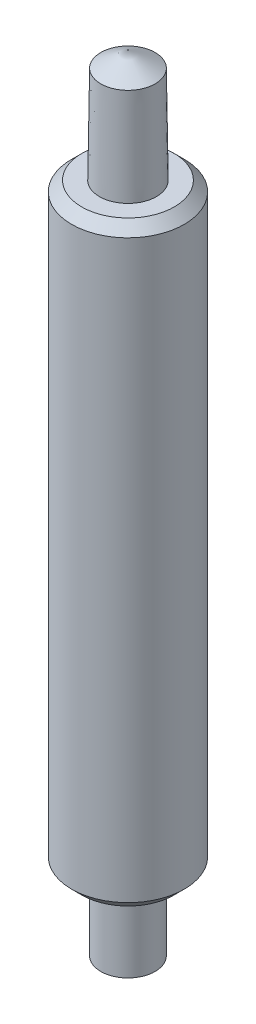
ISO-10303-21;
HEADER;
FILE_DESCRIPTION(('STEP AP214'),'2;1');
FILE_NAME('part.step','',(''),(''),'','','');
FILE_SCHEMA(('AUTOMOTIVE_DESIGN { 1 0 10303 214 1 1 1 1 }'));
ENDSEC;
DATA;
#1=APPLICATION_CONTEXT('core data for automotive mechanical design processes');
#2=APPLICATION_PROTOCOL_DEFINITION('international standard','automotive_design',2000,#1);
#3=PRODUCT_CONTEXT('',#1,'mechanical');
#4=PRODUCT('Part','Part','',(#3));
#5=PRODUCT_RELATED_PRODUCT_CATEGORY('part','',(#4));
#6=PRODUCT_DEFINITION_FORMATION('','',#4);
#7=PRODUCT_DEFINITION_CONTEXT('part definition',#1,'design');
#8=PRODUCT_DEFINITION('design','',#6,#7);
#9=PRODUCT_DEFINITION_SHAPE('','',#8);
#10=(LENGTH_UNIT() NAMED_UNIT(*) SI_UNIT(.MILLI.,.METRE.));
#11=(NAMED_UNIT(*) PLANE_ANGLE_UNIT() SI_UNIT($,.RADIAN.));
#12=(NAMED_UNIT(*) SI_UNIT($,.STERADIAN.) SOLID_ANGLE_UNIT());
#13=UNCERTAINTY_MEASURE_WITH_UNIT(LENGTH_MEASURE(1.E-05),#10,'distance_accuracy_value','');
#14=(GEOMETRIC_REPRESENTATION_CONTEXT(3) GLOBAL_UNCERTAINTY_ASSIGNED_CONTEXT((#13)) GLOBAL_UNIT_ASSIGNED_CONTEXT((#10,
#11,#12)) REPRESENTATION_CONTEXT('',''));
#15=CARTESIAN_POINT('',(0.,0.,0.));
#16=DIRECTION('',(0.,0.,1.));
#17=DIRECTION('',(1.,0.,0.));
#18=AXIS2_PLACEMENT_3D('',#15,#16,#17);
#19=CARTESIAN_POINT('',(-4.09089394844106E-13,0.,0.));
#20=DIRECTION('',(0.,1.,0.));
#21=DIRECTION('',(0.,0.,1.));
#22=AXIS2_PLACEMENT_3D('',#19,#20,#21);
#23=CYLINDRICAL_SURFACE('',#22,0.135000000000408);
#24=CARTESIAN_POINT('',(-4.09089394844106E-13,0.0733916396744956,0.));
#25=DIRECTION('',(0.,1.,0.));
#26=DIRECTION('',(0.,0.,1.));
#27=AXIS2_PLACEMENT_3D('',#24,#25,#26);
#28=CIRCLE('',#27,0.135000000000408);
#29=CARTESIAN_POINT('',(-4.09089394844106E-13,0.0733916396744956,0.135000000000408));
#30=VERTEX_POINT('',#29);
#31=EDGE_CURVE('E52',#30,#30,#28,.T.);
#32=ORIENTED_EDGE('',*,*,#31,.T.);
#33=EDGE_LOOP('',(#32));
#34=FACE_BOUND('',#33,.T.);
#35=CARTESIAN_POINT('',(-4.09089394844106E-13,0.45,0.));
#36=DIRECTION('',(0.,1.,0.));
#37=DIRECTION('',(0.,0.,1.));
#38=AXIS2_PLACEMENT_3D('',#35,#36,#37);
#39=CIRCLE('',#38,0.135000000000408);
#40=CARTESIAN_POINT('',(-4.09089394844106E-13,0.45,0.135000000000408));
#41=VERTEX_POINT('',#40);
#42=EDGE_CURVE('E11',#41,#41,#39,.T.);
#43=ORIENTED_EDGE('',*,*,#42,.F.);
#44=EDGE_LOOP('',(#43));
#45=FACE_BOUND('',#44,.T.);
#46=ADVANCED_FACE('F32',(#34,#45),#23,.T.);
#47=CARTESIAN_POINT('',(0.23,0.45,0.));
#48=DIRECTION('',(0.,-1.,0.));
#49=DIRECTION('',(0.,0.,-1.));
#50=AXIS2_PLACEMENT_3D('',#47,#48,#49);
#51=PLANE('',#50);
#52=ORIENTED_EDGE('',*,*,#42,.T.);
#53=EDGE_LOOP('',(#52));
#54=FACE_BOUND('',#53,.T.);
#55=CARTESIAN_POINT('',(-4.09089394844106E-13,0.45,0.));
#56=DIRECTION('',(0.,1.,0.));
#57=DIRECTION('',(0.,0.,1.));
#58=AXIS2_PLACEMENT_3D('',#55,#56,#57);
#59=CIRCLE('',#58,0.230000000000409);
#60=CARTESIAN_POINT('',(-4.09089394844106E-13,0.45,0.230000000000409));
#61=VERTEX_POINT('',#60);
#62=EDGE_CURVE('E39',#61,#61,#59,.T.);
#63=ORIENTED_EDGE('',*,*,#62,.F.);
#64=EDGE_LOOP('',(#63));
#65=FACE_BOUND('',#64,.T.);
#66=ADVANCED_FACE('F76',(#54,#65),#51,.T.);
#67=CARTESIAN_POINT('',(-4.09089394844106E-13,0.5,0.));
#68=DIRECTION('',(0.,1.,0.));
#69=DIRECTION('',(0.,0.,1.));
#70=AXIS2_PLACEMENT_3D('',#67,#68,#69);
#71=CONICAL_SURFACE('',#70,0.280000000000409,0.785398163397445);
#72=ORIENTED_EDGE('',*,*,#62,.T.);
#73=EDGE_LOOP('',(#72));
#74=FACE_BOUND('',#73,.T.);
#75=CARTESIAN_POINT('',(-4.09089394844106E-13,0.5,0.));
#76=DIRECTION('',(0.,1.,0.));
#77=DIRECTION('',(0.,0.,1.));
#78=AXIS2_PLACEMENT_3D('',#75,#76,#77);
#79=CIRCLE('',#78,0.280000000000409);
#80=CARTESIAN_POINT('',(-4.09089394844106E-13,0.5,0.280000000000409));
#81=VERTEX_POINT('',#80);
#82=EDGE_CURVE('E68',#81,#81,#79,.T.);
#83=ORIENTED_EDGE('',*,*,#82,.F.);
#84=EDGE_LOOP('',(#83));
#85=FACE_BOUND('',#84,.T.);
#86=ADVANCED_FACE('F73',(#74,#85),#71,.T.);
#87=CARTESIAN_POINT('',(-4.09089394844106E-13,0.,0.));
#88=DIRECTION('',(0.,1.,0.));
#89=DIRECTION('',(0.,0.,1.));
#90=AXIS2_PLACEMENT_3D('',#87,#88,#89);
#91=CYLINDRICAL_SURFACE('',#90,0.280000000000409);
#92=ORIENTED_EDGE('',*,*,#82,.T.);
#93=EDGE_LOOP('',(#92));
#94=FACE_BOUND('',#93,.T.);
#95=CARTESIAN_POINT('',(-4.09089394844106E-13,3.36,0.));
#96=DIRECTION('',(0.,1.,0.));
#97=DIRECTION('',(0.,0.,1.));
#98=AXIS2_PLACEMENT_3D('',#95,#96,#97);
#99=CIRCLE('',#98,0.280000000000409);
#100=CARTESIAN_POINT('',(-4.09089394844106E-13,3.36,0.280000000000409));
#101=VERTEX_POINT('',#100);
#102=EDGE_CURVE('E65',#101,#101,#99,.T.);
#103=ORIENTED_EDGE('',*,*,#102,.F.);
#104=EDGE_LOOP('',(#103));
#105=FACE_BOUND('',#104,.T.);
#106=ADVANCED_FACE('F83',(#94,#105),#91,.T.);
#107=CARTESIAN_POINT('',(-4.09089394844106E-13,3.41,0.));
#108=DIRECTION('',(0.,-1.,0.));
#109=DIRECTION('',(0.,0.,-1.));
#110=AXIS2_PLACEMENT_3D('',#107,#108,#109);
#111=CONICAL_SURFACE('',#110,0.230000000000409,0.785398163397459);
#112=ORIENTED_EDGE('',*,*,#102,.T.);
#113=EDGE_LOOP('',(#112));
#114=FACE_BOUND('',#113,.T.);
#115=CARTESIAN_POINT('',(-4.09089394844106E-13,3.41,0.));
#116=DIRECTION('',(0.,1.,0.));
#117=DIRECTION('',(0.,0.,1.));
#118=AXIS2_PLACEMENT_3D('',#115,#116,#117);
#119=CIRCLE('',#118,0.230000000000409);
#120=CARTESIAN_POINT('',(-4.09089394844106E-13,3.41,0.230000000000409));
#121=VERTEX_POINT('',#120);
#122=EDGE_CURVE('E62',#121,#121,#119,.T.);
#123=ORIENTED_EDGE('',*,*,#122,.F.);
#124=EDGE_LOOP('',(#123));
#125=FACE_BOUND('',#124,.T.);
#126=ADVANCED_FACE('F88',(#114,#125),#111,.T.);
#127=CARTESIAN_POINT('',(0.14151260033775,3.41,0.));
#128=DIRECTION('',(0.,1.,0.));
#129=DIRECTION('',(0.,0.,1.));
#130=AXIS2_PLACEMENT_3D('',#127,#128,#129);
#131=PLANE('',#130);
#132=ORIENTED_EDGE('',*,*,#122,.T.);
#133=EDGE_LOOP('',(#132));
#134=FACE_BOUND('',#133,.T.);
#135=CARTESIAN_POINT('',(-4.09089394844106E-13,3.41,0.));
#136=DIRECTION('',(0.,1.,0.));
#137=DIRECTION('',(0.,0.,1.));
#138=AXIS2_PLACEMENT_3D('',#135,#136,#137);
#139=CIRCLE('',#138,0.141512600338159);
#140=CARTESIAN_POINT('',(-4.09089394844106E-13,3.41,0.141512600338159));
#141=VERTEX_POINT('',#140);
#142=EDGE_CURVE('E57',#141,#141,#139,.T.);
#143=ORIENTED_EDGE('',*,*,#142,.F.);
#144=EDGE_LOOP('',(#143));
#145=FACE_BOUND('',#144,.T.);
#146=ADVANCED_FACE('F92',(#134,#145),#131,.T.);
#147=CARTESIAN_POINT('',(-4.09089394844106E-13,3.8920577136594,0.));
#148=DIRECTION('',(0.,-1.,0.));
#149=DIRECTION('',(0.,0.,-1.));
#150=AXIS2_PLACEMENT_3D('',#147,#148,#149);
#151=CONICAL_SURFACE('',#150,0.135000000000408,0.0135091794399531);
#152=ORIENTED_EDGE('',*,*,#142,.T.);
#153=EDGE_LOOP('',(#152));
#154=FACE_BOUND('',#153,.T.);
#155=CARTESIAN_POINT('',(-4.09089394844106E-13,3.8920577136594,0.));
#156=DIRECTION('',(0.,1.,0.));
#157=DIRECTION('',(0.,0.,1.));
#158=AXIS2_PLACEMENT_3D('',#155,#156,#157);
#159=CIRCLE('',#158,0.135000000000408);
#160=CARTESIAN_POINT('',(-4.09089394844106E-13,3.8920577136594,0.135000000000408));
#161=VERTEX_POINT('',#160);
#162=EDGE_CURVE('E54',#161,#161,#159,.T.);
#163=ORIENTED_EDGE('',*,*,#162,.F.);
#164=EDGE_LOOP('',(#163));
#165=FACE_BOUND('',#164,.T.);
#166=ADVANCED_FACE('F96',(#154,#165),#151,.T.);
#167=CARTESIAN_POINT('',(-4.09089394844106E-13,3.97,0.));
#168=DIRECTION('',(0.,-1.,0.));
#169=DIRECTION('',(0.,0.,-1.));
#170=AXIS2_PLACEMENT_3D('',#167,#168,#169);
#171=CONICAL_SURFACE('',#170,0.,1.04719755119791);
#172=ORIENTED_EDGE('',*,*,#162,.T.);
#173=EDGE_LOOP('',(#172));
#174=FACE_BOUND('',#173,.T.);
#175=CARTESIAN_POINT('',(-4.09089394844106E-13,3.97,0.));
#176=VERTEX_POINT('',#175);
#177=VERTEX_LOOP('',#176);
#178=FACE_BOUND('',#177,.T.);
#179=ADVANCED_FACE('F48',(#174,#178),#171,.T.);
#180=CARTESIAN_POINT('',(-4.09089394844106E-13,0.0733916396744956,0.));
#181=DIRECTION('',(0.,1.,0.));
#182=DIRECTION('',(0.,0.,1.));
#183=AXIS2_PLACEMENT_3D('',#180,#181,#182);
#184=CONICAL_SURFACE('',#183,0.135000000000408,1.07284777274937);
#185=CARTESIAN_POINT('',(-4.09089394844106E-13,0.,0.));
#186=VERTEX_POINT('',#185);
#187=VERTEX_LOOP('',#186);
#188=FACE_BOUND('',#187,.T.);
#189=ORIENTED_EDGE('',*,*,#31,.F.);
#190=EDGE_LOOP('',(#189));
#191=FACE_BOUND('',#190,.T.);
#192=ADVANCED_FACE('F45',(#188,#191),#184,.T.);
#193=CLOSED_SHELL('',(#46,#66,#86,#106,#126,#146,#166,#179,#192));
#194=MANIFOLD_SOLID_BREP('B2',#193);
#195=ADVANCED_BREP_SHAPE_REPRESENTATION('',(#18,#194),#14);
#196=SHAPE_DEFINITION_REPRESENTATION(#9,#195);
ENDSEC;
END-ISO-10303-21;
